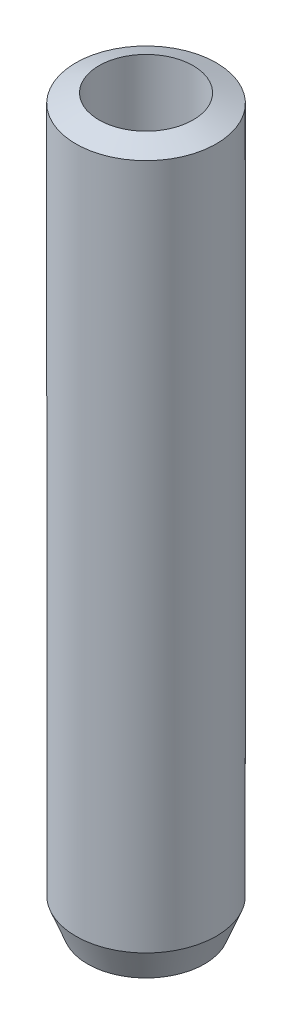
ISO-10303-21;
HEADER;
FILE_DESCRIPTION(('STEP AP214'),'2;1');
FILE_NAME('part.step','',(''),(''),'','','');
FILE_SCHEMA(('AUTOMOTIVE_DESIGN { 1 0 10303 214 1 1 1 1 }'));
ENDSEC;
DATA;
#1=APPLICATION_CONTEXT('core data for automotive mechanical design processes');
#2=APPLICATION_PROTOCOL_DEFINITION('international standard','automotive_design',2000,#1);
#3=PRODUCT_CONTEXT('',#1,'mechanical');
#4=PRODUCT('Part','Part','',(#3));
#5=PRODUCT_RELATED_PRODUCT_CATEGORY('part','',(#4));
#6=PRODUCT_DEFINITION_FORMATION('','',#4);
#7=PRODUCT_DEFINITION_CONTEXT('part definition',#1,'design');
#8=PRODUCT_DEFINITION('design','',#6,#7);
#9=PRODUCT_DEFINITION_SHAPE('','',#8);
#10=(LENGTH_UNIT() NAMED_UNIT(*) SI_UNIT(.MILLI.,.METRE.));
#11=(NAMED_UNIT(*) PLANE_ANGLE_UNIT() SI_UNIT($,.RADIAN.));
#12=(NAMED_UNIT(*) SI_UNIT($,.STERADIAN.) SOLID_ANGLE_UNIT());
#13=UNCERTAINTY_MEASURE_WITH_UNIT(LENGTH_MEASURE(1.E-05),#10,'distance_accuracy_value','');
#14=(GEOMETRIC_REPRESENTATION_CONTEXT(3) GLOBAL_UNCERTAINTY_ASSIGNED_CONTEXT((#13)) GLOBAL_UNIT_ASSIGNED_CONTEXT((#10,
#11,#12)) REPRESENTATION_CONTEXT('',''));
#15=CARTESIAN_POINT('',(0.,0.,0.));
#16=DIRECTION('',(0.,0.,1.));
#17=DIRECTION('',(1.,0.,0.));
#18=AXIS2_PLACEMENT_3D('',#15,#16,#17);
#19=CARTESIAN_POINT('',(0.,207.198024976315,0.));
#20=DIRECTION('',(0.,-1.,0.));
#21=DIRECTION('',(0.,0.,-1.));
#22=AXIS2_PLACEMENT_3D('',#19,#20,#21);
#23=CYLINDRICAL_SURFACE('',#22,20.);
#24=CARTESIAN_POINT('',(0.,203.84843129187,0.));
#25=DIRECTION('',(0.,1.,0.));
#26=DIRECTION('',(0.,0.,1.));
#27=AXIS2_PLACEMENT_3D('',#24,#25,#26);
#28=CIRCLE('',#27,20.);
#29=CARTESIAN_POINT('',(0.,203.84843129187,-20.));
#30=VERTEX_POINT('',#29);
#31=EDGE_CURVE('E50',#30,#30,#28,.F.);
#32=CARTESIAN_POINT('',(0.,8.53703172896248,0.));
#33=DIRECTION('',(0.,1.,0.));
#34=DIRECTION('',(0.,0.,1.));
#35=AXIS2_PLACEMENT_3D('',#32,#33,#34);
#36=CIRCLE('',#35,20.);
#37=CARTESIAN_POINT('',(0.,8.53703172896245,-20.));
#38=VERTEX_POINT('',#37);
#39=EDGE_CURVE('E51',#38,#38,#36,.T.);
#40=CARTESIAN_POINT('',(0.,203.84843129187,-20.));
#41=CARTESIAN_POINT('',(0.,201.813937546423,-20.));
#42=CARTESIAN_POINT('',(0.,199.779443800976,-20.));
#43=CARTESIAN_POINT('',(0.,195.710456310082,-20.));
#44=CARTESIAN_POINT('',(0.,193.675962564635,-20.));
#45=CARTESIAN_POINT('',(0.,189.606975073741,-20.));
#46=CARTESIAN_POINT('',(0.,187.572481328294,-20.));
#47=CARTESIAN_POINT('',(0.,183.503493837401,-20.));
#48=CARTESIAN_POINT('',(0.,181.469000091954,-20.));
#49=CARTESIAN_POINT('',(0.,177.40001260106,-20.));
#50=CARTESIAN_POINT('',(0.,175.365518855613,-20.));
#51=CARTESIAN_POINT('',(0.,171.296531364719,-20.));
#52=CARTESIAN_POINT('',(0.,169.262037619272,-20.));
#53=CARTESIAN_POINT('',(0.,165.193050128378,-20.));
#54=CARTESIAN_POINT('',(0.,163.158556382931,-20.));
#55=CARTESIAN_POINT('',(0.,159.089568892037,-20.));
#56=CARTESIAN_POINT('',(0.,157.05507514659,-20.));
#57=CARTESIAN_POINT('',(0.,152.986087655696,-20.));
#58=CARTESIAN_POINT('',(0.,150.951593910249,-20.));
#59=CARTESIAN_POINT('',(0.,146.882606419355,-20.));
#60=CARTESIAN_POINT('',(0.,144.848112673908,-20.));
#61=CARTESIAN_POINT('',(0.,140.779125183015,-20.));
#62=CARTESIAN_POINT('',(0.,138.744631437568,-20.));
#63=CARTESIAN_POINT('',(0.,134.675643946674,-20.));
#64=CARTESIAN_POINT('',(0.,132.641150201227,-20.));
#65=CARTESIAN_POINT('',(0.,128.572162710333,-20.));
#66=CARTESIAN_POINT('',(0.,126.537668964886,-20.));
#67=CARTESIAN_POINT('',(0.,122.468681473992,-20.));
#68=CARTESIAN_POINT('',(0.,120.434187728545,-20.));
#69=CARTESIAN_POINT('',(0.,116.365200237651,-20.));
#70=CARTESIAN_POINT('',(0.,114.330706492204,-20.));
#71=CARTESIAN_POINT('',(0.,110.26171900131,-20.));
#72=CARTESIAN_POINT('',(0.,108.227225255863,-20.));
#73=CARTESIAN_POINT('',(0.,104.158237764969,-20.));
#74=CARTESIAN_POINT('',(0.,102.123744019522,-20.));
#75=CARTESIAN_POINT('',(0.,98.0547565286285,-20.));
#76=CARTESIAN_POINT('',(0.,96.0202627831815,-20.));
#77=CARTESIAN_POINT('',(0.,91.9512752922876,-20.));
#78=CARTESIAN_POINT('',(0.,89.9167815468406,-20.));
#79=CARTESIAN_POINT('',(0.,85.8477940559467,-20.));
#80=CARTESIAN_POINT('',(0.,83.8133003104998,-20.));
#81=CARTESIAN_POINT('',(0.,79.7443128196059,-20.));
#82=CARTESIAN_POINT('',(0.,77.7098190741589,-20.));
#83=CARTESIAN_POINT('',(0.,73.640831583265,-20.));
#84=CARTESIAN_POINT('',(0.,71.6063378378181,-20.));
#85=CARTESIAN_POINT('',(0.,67.5373503469242,-20.));
#86=CARTESIAN_POINT('',(0.,65.5028566014772,-20.));
#87=CARTESIAN_POINT('',(0.,61.4338691105833,-20.));
#88=CARTESIAN_POINT('',(0.,59.3993753651363,-20.));
#89=CARTESIAN_POINT('',(0.,55.3303878742424,-20.));
#90=CARTESIAN_POINT('',(0.,53.2958941287955,-20.));
#91=CARTESIAN_POINT('',(0.,49.2269066379015,-20.));
#92=CARTESIAN_POINT('',(0.,47.1924128924546,-20.));
#93=CARTESIAN_POINT('',(0.,43.1234254015607,-20.));
#94=CARTESIAN_POINT('',(0.,41.0889316561137,-20.));
#95=CARTESIAN_POINT('',(0.,37.0199441652198,-20.));
#96=CARTESIAN_POINT('',(0.,34.9854504197729,-20.));
#97=CARTESIAN_POINT('',(0.,30.9164629288789,-20.));
#98=CARTESIAN_POINT('',(0.,28.881969183432,-20.));
#99=CARTESIAN_POINT('',(0.,24.8129816925381,-20.));
#100=CARTESIAN_POINT('',(0.,22.7784879470911,-20.));
#101=CARTESIAN_POINT('',(0.,18.7095004561972,-20.));
#102=CARTESIAN_POINT('',(0.,16.6750067107503,-20.));
#103=CARTESIAN_POINT('',(0.,12.6060192198564,-20.));
#104=CARTESIAN_POINT('',(0.,10.5715254744094,-20.));
#105=CARTESIAN_POINT('',(0.,8.53703172896245,-20.));
#106=B_SPLINE_CURVE_WITH_KNOTS('',3,(#40,#41,#42,#43,#44,#45,#46,#47,#48,#49,#50,#51,#52,#53,
#54,#55,#56,#57,#58,#59,#60,#61,#62,#63,#64,#65,#66,#67,#68,#69,#70,#71,#72,#73,#74,#75,#76,#77,
#78,#79,#80,#81,#82,#83,#84,#85,#86,#87,#88,#89,#90,#91,#92,#93,#94,#95,#96,#97,#98,#99,#100,
#101,#102,#103,#104,#105),.UNSPECIFIED.,.F.,.F.,(4,2,2,2,2,2,2,2,2,2,2,2,2,2,2,2,2,2,2,2,2,2,2,
2,2,2,2,2,2,2,2,2,4),(0.,6.10348123634086,12.2069624726817,18.3104437090226,24.4139249453635,
30.5174061817043,36.6208874180452,42.724368654386,48.8278498907269,54.9313311270678,
61.0348123634086,67.1382935997495,73.2417748360904,79.3452560724312,85.4487373087721,
91.552218545113,97.6556997814538,103.759181017795,109.862662254136,115.966143490476,
122.069624726817,128.173105963158,134.276587199499,140.38006843584,146.483549672181,
152.587030908522,158.690512144862,164.793993381203,170.897474617544,177.000955853885,
183.104437090226,189.207918326567,195.311399562908),.UNSPECIFIED.);
#107=EDGE_CURVE('BSEAM39',#30,#38,#106,.T.);
#108=ORIENTED_EDGE('',*,*,#31,.T.);
#109=ORIENTED_EDGE('',*,*,#39,.T.);
#110=ORIENTED_EDGE('',*,*,#107,.T.);
#111=ORIENTED_EDGE('',*,*,#107,.F.);
#112=EDGE_LOOP('',(#108,#110,#109,#111));
#113=FACE_BOUND('',#112,.T.);
#114=ADVANCED_FACE('F39',(#113),#23,.T.);
#115=CARTESIAN_POINT('',(0.,0.,0.));
#116=DIRECTION('',(0.,1.,0.));
#117=DIRECTION('',(0.,0.,1.));
#118=AXIS2_PLACEMENT_3D('',#115,#116,#117);
#119=PLANE('',#118);
#120=CARTESIAN_POINT('',(0.,0.,0.));
#121=DIRECTION('',(0.,1.,0.));
#122=DIRECTION('',(0.,0.,1.));
#123=AXIS2_PLACEMENT_3D('',#120,#121,#122);
#124=CIRCLE('',#123,16.6504063155548);
#125=CARTESIAN_POINT('',(0.,0.,16.6504063155548));
#126=VERTEX_POINT('',#125);
#127=EDGE_CURVE('E10',#126,#126,#124,.F.);
#128=ORIENTED_EDGE('',*,*,#127,.T.);
#129=EDGE_LOOP('',(#128));
#130=FACE_BOUND('',#129,.T.);
#131=CARTESIAN_POINT('',(0.,0.,0.));
#132=DIRECTION('',(0.,1.,0.));
#133=DIRECTION('',(0.,0.,1.));
#134=AXIS2_PLACEMENT_3D('',#131,#132,#133);
#135=CIRCLE('',#134,13.3997241258395);
#136=CARTESIAN_POINT('',(0.,0.,-13.3997241258395));
#137=VERTEX_POINT('',#136);
#138=EDGE_CURVE('E58',#137,#137,#135,.T.);
#139=ORIENTED_EDGE('',*,*,#138,.T.);
#140=EDGE_LOOP('',(#139));
#141=FACE_BOUND('',#140,.T.);
#142=ADVANCED_FACE('F62',(#130,#141),#119,.F.);
#143=CARTESIAN_POINT('',(0.,207.198024976315,0.));
#144=DIRECTION('',(0.,-1.,0.));
#145=DIRECTION('',(0.,0.,-1.));
#146=AXIS2_PLACEMENT_3D('',#143,#144,#145);
#147=CYLINDRICAL_SURFACE('',#146,13.3997241258395);
#148=CARTESIAN_POINT('',(0.,206.438118560887,0.));
#149=DIRECTION('',(0.,-1.,0.));
#150=DIRECTION('',(0.,0.,-1.));
#151=AXIS2_PLACEMENT_3D('',#148,#149,#150);
#152=CIRCLE('',#151,13.3997241258395);
#153=CARTESIAN_POINT('',(0.,206.438118560887,-13.3997241258395));
#154=VERTEX_POINT('',#153);
#155=EDGE_CURVE('E54',#154,#154,#152,.F.);
#156=CARTESIAN_POINT('',(0.,206.438118560887,-13.3997241258395));
#157=CARTESIAN_POINT('',(0.,204.287721492544,-13.3997241258395));
#158=CARTESIAN_POINT('',(0.,202.137324424202,-13.3997241258395));
#159=CARTESIAN_POINT('',(0.,197.836530287516,-13.3997241258395));
#160=CARTESIAN_POINT('',(0.,195.686133219174,-13.3997241258395));
#161=CARTESIAN_POINT('',(0.,191.385339082489,-13.3997241258395));
#162=CARTESIAN_POINT('',(0.,189.234942014146,-13.3997241258395));
#163=CARTESIAN_POINT('',(0.,184.934147877461,-13.3997241258395));
#164=CARTESIAN_POINT('',(0.,182.783750809118,-13.3997241258395));
#165=CARTESIAN_POINT('',(0.,178.482956672433,-13.3997241258395));
#166=CARTESIAN_POINT('',(0.,176.332559604091,-13.3997241258395));
#167=CARTESIAN_POINT('',(0.,172.031765467406,-13.3997241258395));
#168=CARTESIAN_POINT('',(0.,169.881368399063,-13.3997241258395));
#169=CARTESIAN_POINT('',(0.,165.580574262378,-13.3997241258395));
#170=CARTESIAN_POINT('',(0.,163.430177194035,-13.3997241258395));
#171=CARTESIAN_POINT('',(0.,159.12938305735,-13.3997241258395));
#172=CARTESIAN_POINT('',(0.,156.978985989008,-13.3997241258395));
#173=CARTESIAN_POINT('',(0.,152.678191852322,-13.3997241258395));
#174=CARTESIAN_POINT('',(0.,150.52779478398,-13.3997241258395));
#175=CARTESIAN_POINT('',(0.,146.227000647295,-13.3997241258395));
#176=CARTESIAN_POINT('',(0.,144.076603578952,-13.3997241258395));
#177=CARTESIAN_POINT('',(0.,139.775809442267,-13.3997241258395));
#178=CARTESIAN_POINT('',(0.,137.625412373924,-13.3997241258395));
#179=CARTESIAN_POINT('',(0.,133.324618237239,-13.3997241258395));
#180=CARTESIAN_POINT('',(0.,131.174221168897,-13.3997241258395));
#181=CARTESIAN_POINT('',(0.,126.873427032212,-13.3997241258395));
#182=CARTESIAN_POINT('',(0.,124.723029963869,-13.3997241258395));
#183=CARTESIAN_POINT('',(0.,120.422235827184,-13.3997241258395));
#184=CARTESIAN_POINT('',(0.,118.271838758841,-13.3997241258395));
#185=CARTESIAN_POINT('',(0.,113.971044622156,-13.3997241258395));
#186=CARTESIAN_POINT('',(0.,111.820647553814,-13.3997241258395));
#187=CARTESIAN_POINT('',(0.,107.519853417128,-13.3997241258395));
#188=CARTESIAN_POINT('',(0.,105.369456348786,-13.3997241258395));
#189=CARTESIAN_POINT('',(0.,101.068662212101,-13.3997241258395));
#190=CARTESIAN_POINT('',(0.,98.9182651437582,-13.3997241258395));
#191=CARTESIAN_POINT('',(0.,94.617471007073,-13.3997241258395));
#192=CARTESIAN_POINT('',(0.,92.4670739387305,-13.3997241258395));
#193=CARTESIAN_POINT('',(0.,88.1662798020453,-13.3997241258395));
#194=CARTESIAN_POINT('',(0.,86.0158827337028,-13.3997241258395));
#195=CARTESIAN_POINT('',(0.,81.7150885970176,-13.3997241258395));
#196=CARTESIAN_POINT('',(0.,79.564691528675,-13.3997241258395));
#197=CARTESIAN_POINT('',(0.,75.2638973919899,-13.3997241258395));
#198=CARTESIAN_POINT('',(0.,73.1135003236473,-13.3997241258395));
#199=CARTESIAN_POINT('',(0.,68.8127061869622,-13.3997241258395));
#200=CARTESIAN_POINT('',(0.,66.6623091186197,-13.3997241258395));
#201=CARTESIAN_POINT('',(0.,62.3615149819345,-13.3997241258395));
#202=CARTESIAN_POINT('',(0.,60.2111179135919,-13.3997241258395));
#203=CARTESIAN_POINT('',(0.,55.9103237769068,-13.3997241258395));
#204=CARTESIAN_POINT('',(0.,53.7599267085642,-13.3997241258395));
#205=CARTESIAN_POINT('',(0.,49.4591325718791,-13.3997241258395));
#206=CARTESIAN_POINT('',(0.,47.3087355035365,-13.3997241258395));
#207=CARTESIAN_POINT('',(0.,43.0079413668514,-13.3997241258395));
#208=CARTESIAN_POINT('',(0.,40.8575442985088,-13.3997241258395));
#209=CARTESIAN_POINT('',(0.,36.5567501618237,-13.3997241258395));
#210=CARTESIAN_POINT('',(0.,34.4063530934811,-13.3997241258395));
#211=CARTESIAN_POINT('',(0.,30.1055589567959,-13.3997241258395));
#212=CARTESIAN_POINT('',(0.,27.9551618884534,-13.3997241258395));
#213=CARTESIAN_POINT('',(0.,23.6543677517683,-13.3997241258395));
#214=CARTESIAN_POINT('',(0.,21.5039706834257,-13.3997241258395));
#215=CARTESIAN_POINT('',(0.,17.2031765467406,-13.3997241258395));
#216=CARTESIAN_POINT('',(0.,15.052779478398,-13.3997241258395));
#217=CARTESIAN_POINT('',(0.,10.7519853417128,-13.3997241258395));
#218=CARTESIAN_POINT('',(0.,8.60158827337027,-13.3997241258395));
#219=CARTESIAN_POINT('',(0.,4.30079413668513,-13.3997241258395));
#220=CARTESIAN_POINT('',(0.,2.15039706834255,-13.3997241258395));
#221=CARTESIAN_POINT('',(0.,0.,-13.3997241258395));
#222=B_SPLINE_CURVE_WITH_KNOTS('',3,(#156,#157,#158,#159,#160,#161,#162,#163,#164,#165,#166,
#167,#168,#169,#170,#171,#172,#173,#174,#175,#176,#177,#178,#179,#180,#181,#182,#183,#184,#185,
#186,#187,#188,#189,#190,#191,#192,#193,#194,#195,#196,#197,#198,#199,#200,#201,#202,#203,#204,
#205,#206,#207,#208,#209,#210,#211,#212,#213,#214,#215,#216,#217,#218,#219,#220,#221),
.UNSPECIFIED.,.F.,.F.,(4,2,2,2,2,2,2,2,2,2,2,2,2,2,2,2,2,2,2,2,2,2,2,2,2,2,2,2,2,2,2,2,4),(0.,
6.45119120502771,12.9023824100554,19.3535736150831,25.8047648201108,32.2559560251386,
38.7071472301662,45.158338435194,51.6095296402217,58.0607208452494,64.5119120502771,
70.9631032553048,77.4142944603325,83.8654856653602,90.3166768703879,96.7678680754156,
103.219059280443,109.670250485471,116.121441690499,122.572632895526,129.023824100554,
135.475015305582,141.92620651061,148.377397715637,154.828588920665,161.279780125693,
167.73097133072,174.182162535748,180.633353740776,187.084544945804,193.535736150831,
199.986927355859,206.438118560887),.UNSPECIFIED.);
#223=EDGE_CURVE('BSEAM68',#154,#137,#222,.T.);
#224=ORIENTED_EDGE('',*,*,#155,.T.);
#225=ORIENTED_EDGE('',*,*,#138,.F.);
#226=ORIENTED_EDGE('',*,*,#223,.T.);
#227=ORIENTED_EDGE('',*,*,#223,.F.);
#228=EDGE_LOOP('',(#224,#226,#225,#227));
#229=FACE_BOUND('',#228,.T.);
#230=ADVANCED_FACE('F68',(#229),#147,.F.);
#231=CARTESIAN_POINT('',(0.,207.198024976315,0.));
#232=DIRECTION('',(0.,-1.,0.));
#233=DIRECTION('',(0.,0.,-1.));
#234=AXIS2_PLACEMENT_3D('',#231,#232,#233);
#235=CONICAL_SURFACE('',#234,11.4629682710377,1.19689306023564);
#236=ORIENTED_EDGE('',*,*,#31,.F.);
#237=EDGE_LOOP('',(#236));
#238=FACE_BOUND('',#237,.T.);
#239=ORIENTED_EDGE('',*,*,#155,.F.);
#240=EDGE_LOOP('',(#239));
#241=FACE_BOUND('',#240,.T.);
#242=ADVANCED_FACE('F66',(#238,#241),#235,.T.);
#243=CARTESIAN_POINT('',(0.,8.53703172896248,0.));
#244=DIRECTION('',(0.,1.,0.));
#245=DIRECTION('',(0.,0.,1.));
#246=AXIS2_PLACEMENT_3D('',#243,#244,#245);
#247=CONICAL_SURFACE('',#246,20.,0.373903266559264);
#248=ORIENTED_EDGE('',*,*,#127,.F.);
#249=EDGE_LOOP('',(#248));
#250=FACE_BOUND('',#249,.T.);
#251=ORIENTED_EDGE('',*,*,#39,.F.);
#252=EDGE_LOOP('',(#251));
#253=FACE_BOUND('',#252,.T.);
#254=ADVANCED_FACE('F45',(#250,#253),#247,.T.);
#255=CLOSED_SHELL('',(#114,#142,#230,#242,#254));
#256=MANIFOLD_SOLID_BREP('B2',#255);
#257=ADVANCED_BREP_SHAPE_REPRESENTATION('',(#18,#256),#14);
#258=SHAPE_DEFINITION_REPRESENTATION(#9,#257);
ENDSEC;
END-ISO-10303-21;
